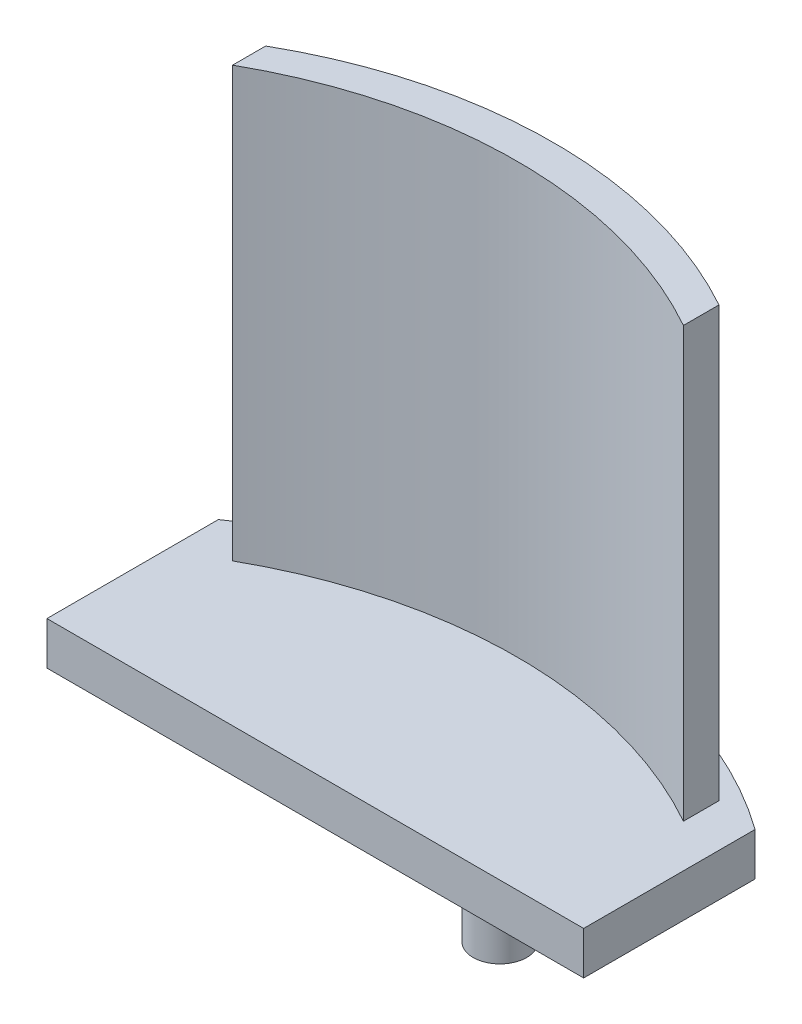
ISO-10303-21;
HEADER;
FILE_DESCRIPTION(('STEP AP214'),'2;1');
FILE_NAME('part.step','',(''),(''),'','','');
FILE_SCHEMA(('AUTOMOTIVE_DESIGN { 1 0 10303 214 1 1 1 1 }'));
ENDSEC;
DATA;
#1=APPLICATION_CONTEXT('core data for automotive mechanical design processes');
#2=APPLICATION_PROTOCOL_DEFINITION('international standard','automotive_design',2000,#1);
#3=PRODUCT_CONTEXT('',#1,'mechanical');
#4=PRODUCT('Part','Part','',(#3));
#5=PRODUCT_RELATED_PRODUCT_CATEGORY('part','',(#4));
#6=PRODUCT_DEFINITION_FORMATION('','',#4);
#7=PRODUCT_DEFINITION_CONTEXT('part definition',#1,'design');
#8=PRODUCT_DEFINITION('design','',#6,#7);
#9=PRODUCT_DEFINITION_SHAPE('','',#8);
#10=(LENGTH_UNIT() NAMED_UNIT(*) SI_UNIT(.MILLI.,.METRE.));
#11=(NAMED_UNIT(*) PLANE_ANGLE_UNIT() SI_UNIT($,.RADIAN.));
#12=(NAMED_UNIT(*) SI_UNIT($,.STERADIAN.) SOLID_ANGLE_UNIT());
#13=UNCERTAINTY_MEASURE_WITH_UNIT(LENGTH_MEASURE(1.E-05),#10,'distance_accuracy_value','');
#14=(GEOMETRIC_REPRESENTATION_CONTEXT(3) GLOBAL_UNCERTAINTY_ASSIGNED_CONTEXT((#13)) GLOBAL_UNIT_ASSIGNED_CONTEXT((#10,
#11,#12)) REPRESENTATION_CONTEXT('',''));
#15=CARTESIAN_POINT('',(0.,0.,0.));
#16=DIRECTION('',(0.,0.,1.));
#17=DIRECTION('',(1.,0.,0.));
#18=AXIS2_PLACEMENT_3D('',#15,#16,#17);
#19=CARTESIAN_POINT('',(15.875,2.54,-4.49445419993906));
#20=DIRECTION('',(0.,-1.,0.));
#21=DIRECTION('',(0.,0.,-1.));
#22=AXIS2_PLACEMENT_3D('',#19,#20,#21);
#23=PLANE('',#22);
#24=DIRECTION('',(0.,0.,1.));
#25=VECTOR('',#24,1.);
#26=CARTESIAN_POINT('',(0.,2.54,0.));
#27=LINE('',#26,#25);
#28=CARTESIAN_POINT('',(0.,2.54,-26.649569903975));
#29=VERTEX_POINT('',#28);
#30=CARTESIAN_POINT('',(0.,2.54,-16.51));
#31=VERTEX_POINT('',#30);
#32=EDGE_CURVE('E109',#29,#31,#27,.T.);
#33=ORIENTED_EDGE('',*,*,#32,.T.);
#34=DIRECTION('',(1.,0.,0.));
#35=VECTOR('',#34,1.);
#36=CARTESIAN_POINT('',(0.,2.54,-16.51));
#37=LINE('',#36,#35);
#38=CARTESIAN_POINT('',(31.75,2.54,-16.51));
#39=VERTEX_POINT('',#38);
#40=EDGE_CURVE('E96',#31,#39,#37,.T.);
#41=ORIENTED_EDGE('',*,*,#40,.T.);
#42=DIRECTION('',(0.,0.,-1.));
#43=VECTOR('',#42,1.);
#44=CARTESIAN_POINT('',(31.75,2.54,0.));
#45=LINE('',#44,#43);
#46=CARTESIAN_POINT('',(31.75,2.54,-26.649569903975));
#47=VERTEX_POINT('',#46);
#48=EDGE_CURVE('E116',#39,#47,#45,.T.);
#49=ORIENTED_EDGE('',*,*,#48,.T.);
#50=CARTESIAN_POINT('',(15.875,2.54,-4.49445419993906));
#51=DIRECTION('',(0.,1.,0.));
#52=DIRECTION('',(0.,0.,-1.));
#53=AXIS2_PLACEMENT_3D('',#50,#51,#52);
#54=CIRCLE('',#53,27.2555458000609);
#55=EDGE_CURVE('E114',#47,#29,#54,.T.);
#56=ORIENTED_EDGE('',*,*,#55,.T.);
#57=EDGE_LOOP('',(#33,#41,#49,#56));
#58=FACE_BOUND('',#57,.T.);
#59=CARTESIAN_POINT('',(15.875,2.54,-1.27));
#60=DIRECTION('',(0.,-1.,0.));
#61=DIRECTION('',(0.,0.,-1.));
#62=AXIS2_PLACEMENT_3D('',#59,#60,#61);
#63=CIRCLE('',#62,27.178);
#64=CARTESIAN_POINT('',(2.54,2.54,-24.9516692612662));
#65=VERTEX_POINT('',#64);
#66=CARTESIAN_POINT('',(29.21,2.54,-24.9516692612662));
#67=VERTEX_POINT('',#66);
#68=EDGE_CURVE('E140',#65,#67,#63,.T.);
#69=ORIENTED_EDGE('',*,*,#68,.F.);
#70=DIRECTION('',(0.,0.,1.));
#71=VECTOR('',#70,1.);
#72=CARTESIAN_POINT('',(2.54,2.54,-26.9117064784804));
#73=LINE('',#72,#71);
#74=CARTESIAN_POINT('',(2.54,2.54,-26.9117064784804));
#75=VERTEX_POINT('',#74);
#76=EDGE_CURVE('E146',#75,#65,#73,.T.);
#77=ORIENTED_EDGE('',*,*,#76,.F.);
#78=CARTESIAN_POINT('',(16.002,2.54,-3.302));
#79=DIRECTION('',(0.,1.,0.));
#80=DIRECTION('',(0.,0.,-1.));
#81=AXIS2_PLACEMENT_3D('',#78,#79,#80);
#82=CIRCLE('',#81,27.178);
#83=CARTESIAN_POINT('',(29.21,2.54,-27.0547350004163));
#84=VERTEX_POINT('',#83);
#85=EDGE_CURVE('E156',#84,#75,#82,.T.);
#86=ORIENTED_EDGE('',*,*,#85,.F.);
#87=DIRECTION('',(0.,0.,-1.));
#88=VECTOR('',#87,1.);
#89=CARTESIAN_POINT('',(29.21,2.54,-27.0547350004163));
#90=LINE('',#89,#88);
#91=EDGE_CURVE('E56',#67,#84,#90,.T.);
#92=ORIENTED_EDGE('',*,*,#91,.F.);
#93=EDGE_LOOP('',(#69,#77,#86,#92));
#94=FACE_BOUND('',#93,.T.);
#95=ADVANCED_FACE('F33',(#58,#94),#23,.F.);
#96=CARTESIAN_POINT('',(0.,2.54,0.));
#97=DIRECTION('',(1.,0.,0.));
#98=DIRECTION('',(0.,0.,-1.));
#99=AXIS2_PLACEMENT_3D('',#96,#97,#98);
#100=PLANE('',#99);
#101=DIRECTION('',(0.,0.,1.));
#102=VECTOR('',#101,1.);
#103=CARTESIAN_POINT('',(0.,0.,0.));
#104=LINE('',#103,#102);
#105=CARTESIAN_POINT('',(0.,0.,-26.649569903975));
#106=VERTEX_POINT('',#105);
#107=CARTESIAN_POINT('',(0.,0.,-16.51));
#108=VERTEX_POINT('',#107);
#109=EDGE_CURVE('E111',#106,#108,#104,.T.);
#110=ORIENTED_EDGE('',*,*,#109,.T.);
#111=DIRECTION('',(0.,-1.,0.));
#112=VECTOR('',#111,1.);
#113=CARTESIAN_POINT('',(0.,2.54,-16.51));
#114=LINE('',#113,#112);
#115=EDGE_CURVE('E48',#31,#108,#114,.T.);
#116=ORIENTED_EDGE('',*,*,#115,.F.);
#117=ORIENTED_EDGE('',*,*,#32,.F.);
#118=DIRECTION('',(0.,-1.,0.));
#119=VECTOR('',#118,1.);
#120=CARTESIAN_POINT('',(0.,2.54,-26.649569903975));
#121=LINE('',#120,#119);
#122=EDGE_CURVE('E41',#29,#106,#121,.T.);
#123=ORIENTED_EDGE('',*,*,#122,.T.);
#124=EDGE_LOOP('',(#110,#116,#117,#123));
#125=FACE_BOUND('',#124,.T.);
#126=ADVANCED_FACE('F35',(#125),#100,.F.);
#127=CARTESIAN_POINT('',(31.75,2.54,0.));
#128=DIRECTION('',(-1.,0.,0.));
#129=DIRECTION('',(0.,0.,1.));
#130=AXIS2_PLACEMENT_3D('',#127,#128,#129);
#131=PLANE('',#130);
#132=ORIENTED_EDGE('',*,*,#48,.F.);
#133=DIRECTION('',(0.,-1.,0.));
#134=VECTOR('',#133,1.);
#135=CARTESIAN_POINT('',(31.75,2.54,-16.51));
#136=LINE('',#135,#134);
#137=CARTESIAN_POINT('',(31.75,0.,-16.51));
#138=VERTEX_POINT('',#137);
#139=EDGE_CURVE('E99',#39,#138,#136,.T.);
#140=ORIENTED_EDGE('',*,*,#139,.T.);
#141=DIRECTION('',(0.,0.,-1.));
#142=VECTOR('',#141,1.);
#143=CARTESIAN_POINT('',(31.75,0.,0.));
#144=LINE('',#143,#142);
#145=CARTESIAN_POINT('',(31.75,0.,-26.649569903975));
#146=VERTEX_POINT('',#145);
#147=EDGE_CURVE('E120',#138,#146,#144,.T.);
#148=ORIENTED_EDGE('',*,*,#147,.T.);
#149=DIRECTION('',(0.,-1.,0.));
#150=VECTOR('',#149,1.);
#151=CARTESIAN_POINT('',(31.75,2.54,-26.649569903975));
#152=LINE('',#151,#150);
#153=EDGE_CURVE('E11',#47,#146,#152,.T.);
#154=ORIENTED_EDGE('',*,*,#153,.F.);
#155=EDGE_LOOP('',(#132,#140,#148,#154));
#156=FACE_BOUND('',#155,.T.);
#157=ADVANCED_FACE('F198',(#156),#131,.F.);
#158=CARTESIAN_POINT('',(15.875,2.54,-4.49445419993906));
#159=DIRECTION('',(0.,-1.,0.));
#160=DIRECTION('',(0.,0.,-1.));
#161=AXIS2_PLACEMENT_3D('',#158,#159,#160);
#162=CYLINDRICAL_SURFACE('',#161,27.2555458000609);
#163=CARTESIAN_POINT('',(15.875,0.,-4.49445419993906));
#164=DIRECTION('',(0.,1.,0.));
#165=DIRECTION('',(0.,0.,-1.));
#166=AXIS2_PLACEMENT_3D('',#163,#164,#165);
#167=CIRCLE('',#166,27.2555458000609);
#168=EDGE_CURVE('E117',#146,#106,#167,.T.);
#169=ORIENTED_EDGE('',*,*,#168,.T.);
#170=ORIENTED_EDGE('',*,*,#122,.F.);
#171=ORIENTED_EDGE('',*,*,#55,.F.);
#172=ORIENTED_EDGE('',*,*,#153,.T.);
#173=EDGE_LOOP('',(#169,#170,#171,#172));
#174=FACE_BOUND('',#173,.T.);
#175=ADVANCED_FACE('F204',(#174),#162,.T.);
#176=CARTESIAN_POINT('',(15.875,0.,-4.49445419993906));
#177=DIRECTION('',(0.,-1.,0.));
#178=DIRECTION('',(0.,0.,-1.));
#179=AXIS2_PLACEMENT_3D('',#176,#177,#178);
#180=PLANE('',#179);
#181=CARTESIAN_POINT('',(14.732,0.,-28.575));
#182=DIRECTION('',(0.,-1.,0.));
#183=DIRECTION('',(0.,0.,-1.));
#184=AXIS2_PLACEMENT_3D('',#181,#182,#183);
#185=CIRCLE('',#184,1.5875);
#186=CARTESIAN_POINT('',(14.732,0.,-30.1625));
#187=VERTEX_POINT('',#186);
#188=EDGE_CURVE('E136',#187,#187,#185,.T.);
#189=ORIENTED_EDGE('',*,*,#188,.F.);
#190=EDGE_LOOP('',(#189));
#191=FACE_BOUND('',#190,.T.);
#192=DIRECTION('',(1.,0.,0.));
#193=VECTOR('',#192,1.);
#194=CARTESIAN_POINT('',(0.,0.,-16.51));
#195=LINE('',#194,#193);
#196=EDGE_CURVE('E103',#108,#138,#195,.T.);
#197=ORIENTED_EDGE('',*,*,#196,.F.);
#198=ORIENTED_EDGE('',*,*,#109,.F.);
#199=ORIENTED_EDGE('',*,*,#168,.F.);
#200=ORIENTED_EDGE('',*,*,#147,.F.);
#201=EDGE_LOOP('',(#197,#198,#199,#200));
#202=FACE_BOUND('',#201,.T.);
#203=ADVANCED_FACE('F131',(#191,#202),#180,.T.);
#204=CARTESIAN_POINT('',(15.875,27.94,-1.27));
#205=DIRECTION('',(0.,-1.,0.));
#206=DIRECTION('',(0.,0.,-1.));
#207=AXIS2_PLACEMENT_3D('',#204,#205,#206);
#208=CYLINDRICAL_SURFACE('',#207,27.178);
#209=ORIENTED_EDGE('',*,*,#68,.T.);
#210=DIRECTION('',(0.,-1.,0.));
#211=VECTOR('',#210,1.);
#212=CARTESIAN_POINT('',(29.21,27.94,-24.9516692612662));
#213=LINE('',#212,#211);
#214=CARTESIAN_POINT('',(29.21,27.94,-24.9516692612662));
#215=VERTEX_POINT('',#214);
#216=EDGE_CURVE('E123',#215,#67,#213,.T.);
#217=ORIENTED_EDGE('',*,*,#216,.F.);
#218=CARTESIAN_POINT('',(15.875,27.94,-1.27));
#219=DIRECTION('',(0.,-1.,0.));
#220=DIRECTION('',(0.,0.,-1.));
#221=AXIS2_PLACEMENT_3D('',#218,#219,#220);
#222=CIRCLE('',#221,27.178);
#223=CARTESIAN_POINT('',(2.54,27.94,-24.9516692612662));
#224=VERTEX_POINT('',#223);
#225=EDGE_CURVE('E142',#224,#215,#222,.T.);
#226=ORIENTED_EDGE('',*,*,#225,.F.);
#227=DIRECTION('',(0.,-1.,0.));
#228=VECTOR('',#227,1.);
#229=CARTESIAN_POINT('',(2.54,27.94,-24.9516692612662));
#230=LINE('',#229,#228);
#231=EDGE_CURVE('E152',#224,#65,#230,.T.);
#232=ORIENTED_EDGE('',*,*,#231,.T.);
#233=EDGE_LOOP('',(#209,#217,#226,#232));
#234=FACE_BOUND('',#233,.T.);
#235=ADVANCED_FACE('F175',(#234),#208,.F.);
#236=CARTESIAN_POINT('',(29.21,27.94,-27.0547350004163));
#237=DIRECTION('',(-1.,0.,0.));
#238=DIRECTION('',(0.,0.,1.));
#239=AXIS2_PLACEMENT_3D('',#236,#237,#238);
#240=PLANE('',#239);
#241=ORIENTED_EDGE('',*,*,#91,.T.);
#242=DIRECTION('',(0.,-1.,0.));
#243=VECTOR('',#242,1.);
#244=CARTESIAN_POINT('',(29.21,27.94,-27.0547350004163));
#245=LINE('',#244,#243);
#246=CARTESIAN_POINT('',(29.21,27.94,-27.0547350004163));
#247=VERTEX_POINT('',#246);
#248=EDGE_CURVE('E165',#247,#84,#245,.T.);
#249=ORIENTED_EDGE('',*,*,#248,.F.);
#250=DIRECTION('',(0.,0.,-1.));
#251=VECTOR('',#250,1.);
#252=CARTESIAN_POINT('',(29.21,27.94,-27.0547350004163));
#253=LINE('',#252,#251);
#254=EDGE_CURVE('E145',#215,#247,#253,.T.);
#255=ORIENTED_EDGE('',*,*,#254,.F.);
#256=ORIENTED_EDGE('',*,*,#216,.T.);
#257=EDGE_LOOP('',(#241,#249,#255,#256));
#258=FACE_BOUND('',#257,.T.);
#259=ADVANCED_FACE('F172',(#258),#240,.F.);
#260=CARTESIAN_POINT('',(16.002,27.94,-3.302));
#261=DIRECTION('',(0.,-1.,0.));
#262=DIRECTION('',(0.,0.,-1.));
#263=AXIS2_PLACEMENT_3D('',#260,#261,#262);
#264=CYLINDRICAL_SURFACE('',#263,27.178);
#265=ORIENTED_EDGE('',*,*,#85,.T.);
#266=DIRECTION('',(0.,-1.,0.));
#267=VECTOR('',#266,1.);
#268=CARTESIAN_POINT('',(2.53999999999998,27.94,-26.9117064784804));
#269=LINE('',#268,#267);
#270=CARTESIAN_POINT('',(2.53999999999998,27.94,-26.9117064784804));
#271=VERTEX_POINT('',#270);
#272=EDGE_CURVE('E163',#271,#75,#269,.T.);
#273=ORIENTED_EDGE('',*,*,#272,.F.);
#274=CARTESIAN_POINT('',(16.002,27.94,-3.302));
#275=DIRECTION('',(0.,1.,0.));
#276=DIRECTION('',(0.,0.,-1.));
#277=AXIS2_PLACEMENT_3D('',#274,#275,#276);
#278=CIRCLE('',#277,27.178);
#279=EDGE_CURVE('E148',#247,#271,#278,.T.);
#280=ORIENTED_EDGE('',*,*,#279,.F.);
#281=ORIENTED_EDGE('',*,*,#248,.T.);
#282=EDGE_LOOP('',(#265,#273,#280,#281));
#283=FACE_BOUND('',#282,.T.);
#284=ADVANCED_FACE('F181',(#283),#264,.T.);
#285=CARTESIAN_POINT('',(2.54,27.94,-26.9117064784804));
#286=DIRECTION('',(1.,0.,0.));
#287=DIRECTION('',(0.,0.,-1.));
#288=AXIS2_PLACEMENT_3D('',#285,#286,#287);
#289=PLANE('',#288);
#290=ORIENTED_EDGE('',*,*,#76,.T.);
#291=ORIENTED_EDGE('',*,*,#231,.F.);
#292=DIRECTION('',(0.,0.,1.));
#293=VECTOR('',#292,1.);
#294=CARTESIAN_POINT('',(2.54,27.94,-26.9117064784804));
#295=LINE('',#294,#293);
#296=EDGE_CURVE('E150',#271,#224,#295,.T.);
#297=ORIENTED_EDGE('',*,*,#296,.F.);
#298=ORIENTED_EDGE('',*,*,#272,.T.);
#299=EDGE_LOOP('',(#290,#291,#297,#298));
#300=FACE_BOUND('',#299,.T.);
#301=ADVANCED_FACE('F178',(#300),#289,.F.);
#302=CARTESIAN_POINT('',(15.875,27.94,-1.27));
#303=DIRECTION('',(0.,-1.,0.));
#304=DIRECTION('',(0.,0.,-1.));
#305=AXIS2_PLACEMENT_3D('',#302,#303,#304);
#306=PLANE('',#305);
#307=ORIENTED_EDGE('',*,*,#225,.T.);
#308=ORIENTED_EDGE('',*,*,#254,.T.);
#309=ORIENTED_EDGE('',*,*,#279,.T.);
#310=ORIENTED_EDGE('',*,*,#296,.T.);
#311=EDGE_LOOP('',(#307,#308,#309,#310));
#312=FACE_BOUND('',#311,.T.);
#313=ADVANCED_FACE('F183',(#312),#306,.F.);
#314=CARTESIAN_POINT('',(0.,2.54,-16.51));
#315=DIRECTION('',(0.,0.,-1.));
#316=DIRECTION('',(-1.,0.,0.));
#317=AXIS2_PLACEMENT_3D('',#314,#315,#316);
#318=PLANE('',#317);
#319=ORIENTED_EDGE('',*,*,#196,.T.);
#320=ORIENTED_EDGE('',*,*,#139,.F.);
#321=ORIENTED_EDGE('',*,*,#40,.F.);
#322=ORIENTED_EDGE('',*,*,#115,.T.);
#323=EDGE_LOOP('',(#319,#320,#321,#322));
#324=FACE_BOUND('',#323,.T.);
#325=ADVANCED_FACE('F97',(#324),#318,.F.);
#326=CARTESIAN_POINT('',(14.732,-12.7,-28.575));
#327=DIRECTION('',(0.,1.,0.));
#328=DIRECTION('',(0.,0.,1.));
#329=AXIS2_PLACEMENT_3D('',#326,#327,#328);
#330=CYLINDRICAL_SURFACE('',#329,1.5875);
#331=CARTESIAN_POINT('',(14.732,-12.7,-28.575));
#332=DIRECTION('',(0.,-1.,0.));
#333=DIRECTION('',(0.,0.,-1.));
#334=AXIS2_PLACEMENT_3D('',#331,#332,#333);
#335=CIRCLE('',#334,1.5875);
#336=CARTESIAN_POINT('',(14.732,-12.7,-30.1625));
#337=VERTEX_POINT('',#336);
#338=EDGE_CURVE('E133',#337,#337,#335,.T.);
#339=ORIENTED_EDGE('',*,*,#338,.F.);
#340=EDGE_LOOP('',(#339));
#341=FACE_BOUND('',#340,.T.);
#342=ORIENTED_EDGE('',*,*,#188,.T.);
#343=EDGE_LOOP('',(#342));
#344=FACE_BOUND('',#343,.T.);
#345=ADVANCED_FACE('F190',(#341,#344),#330,.T.);
#346=CARTESIAN_POINT('',(14.732,-12.7,-28.575));
#347=DIRECTION('',(0.,-1.,0.));
#348=DIRECTION('',(0.,0.,-1.));
#349=AXIS2_PLACEMENT_3D('',#346,#347,#348);
#350=PLANE('',#349);
#351=ORIENTED_EDGE('',*,*,#338,.T.);
#352=EDGE_LOOP('',(#351));
#353=FACE_BOUND('',#352,.T.);
#354=ADVANCED_FACE('F233',(#353),#350,.T.);
#355=CLOSED_SHELL('',(#95,#126,#157,#175,#203,#235,#259,#284,#301,#313,#325,#345,#354));
#356=MANIFOLD_SOLID_BREP('B2',#355);
#357=ADVANCED_BREP_SHAPE_REPRESENTATION('',(#18,#356),#14);
#358=SHAPE_DEFINITION_REPRESENTATION(#9,#357);
ENDSEC;
END-ISO-10303-21;
